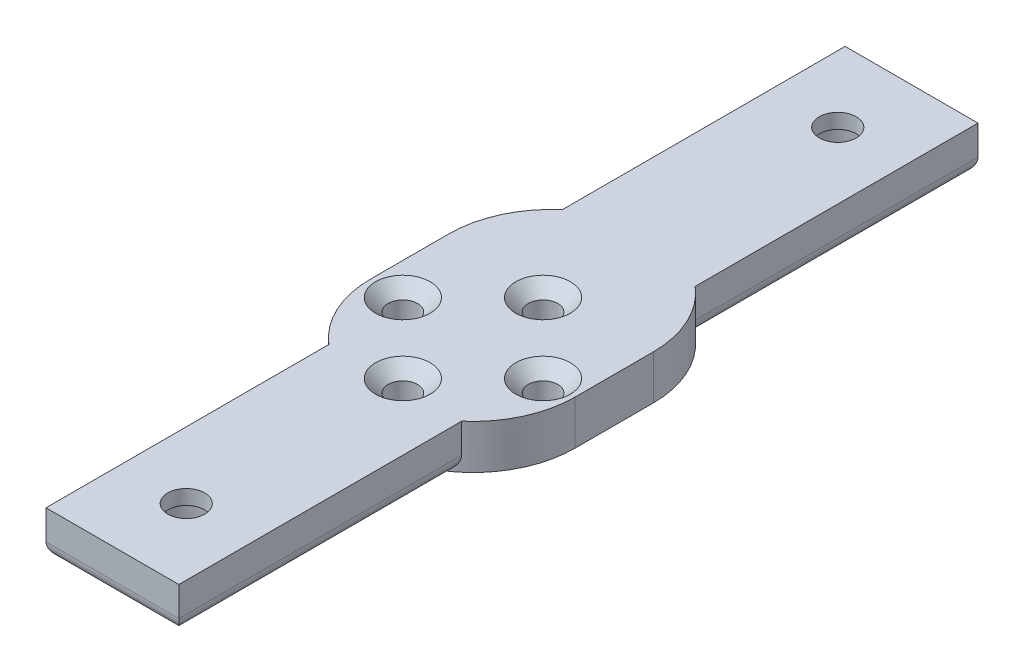
ISO-10303-21;
HEADER;
FILE_DESCRIPTION(('STEP AP214'),'2;1');
FILE_NAME('part.step','',(''),(''),'','','');
FILE_SCHEMA(('AUTOMOTIVE_DESIGN { 1 0 10303 214 1 1 1 1 }'));
ENDSEC;
DATA;
#1=APPLICATION_CONTEXT('core data for automotive mechanical design processes');
#2=APPLICATION_PROTOCOL_DEFINITION('international standard','automotive_design',2000,#1);
#3=PRODUCT_CONTEXT('',#1,'mechanical');
#4=PRODUCT('Part','Part','',(#3));
#5=PRODUCT_RELATED_PRODUCT_CATEGORY('part','',(#4));
#6=PRODUCT_DEFINITION_FORMATION('','',#4);
#7=PRODUCT_DEFINITION_CONTEXT('part definition',#1,'design');
#8=PRODUCT_DEFINITION('design','',#6,#7);
#9=PRODUCT_DEFINITION_SHAPE('','',#8);
#10=(LENGTH_UNIT() NAMED_UNIT(*) SI_UNIT(.MILLI.,.METRE.));
#11=(NAMED_UNIT(*) PLANE_ANGLE_UNIT() SI_UNIT($,.RADIAN.));
#12=(NAMED_UNIT(*) SI_UNIT($,.STERADIAN.) SOLID_ANGLE_UNIT());
#13=UNCERTAINTY_MEASURE_WITH_UNIT(LENGTH_MEASURE(1.E-05),#10,'distance_accuracy_value','');
#14=(GEOMETRIC_REPRESENTATION_CONTEXT(3) GLOBAL_UNCERTAINTY_ASSIGNED_CONTEXT((#13)) GLOBAL_UNIT_ASSIGNED_CONTEXT((#10,
#11,#12)) REPRESENTATION_CONTEXT('',''));
#15=CARTESIAN_POINT('',(0.,0.,0.));
#16=DIRECTION('',(0.,0.,1.));
#17=DIRECTION('',(1.,0.,0.));
#18=AXIS2_PLACEMENT_3D('',#15,#16,#17);
#19=CARTESIAN_POINT('',(0.,0.,44.14));
#20=DIRECTION('',(0.,1.,0.));
#21=DIRECTION('',(0.,0.,1.));
#22=AXIS2_PLACEMENT_3D('',#19,#20,#21);
#23=CYLINDRICAL_SURFACE('',#22,2.5);
#24=CARTESIAN_POINT('',(0.,6.,44.14));
#25=DIRECTION('',(0.,1.,0.));
#26=DIRECTION('',(0.,0.,1.));
#27=AXIS2_PLACEMENT_3D('',#24,#25,#26);
#28=CIRCLE('',#27,2.5);
#29=CARTESIAN_POINT('',(0.,6.,46.64));
#30=VERTEX_POINT('',#29);
#31=EDGE_CURVE('E451',#30,#30,#28,.T.);
#32=ORIENTED_EDGE('',*,*,#31,.T.);
#33=EDGE_LOOP('',(#32));
#34=FACE_BOUND('',#33,.T.);
#35=CARTESIAN_POINT('',(0.,4.,44.14));
#36=DIRECTION('',(0.,-1.,0.));
#37=DIRECTION('',(0.,0.,-1.));
#38=AXIS2_PLACEMENT_3D('',#35,#36,#37);
#39=CIRCLE('',#38,2.5);
#40=CARTESIAN_POINT('',(0.,4.,41.64));
#41=VERTEX_POINT('',#40);
#42=EDGE_CURVE('E45',#41,#41,#39,.F.);
#43=ORIENTED_EDGE('',*,*,#42,.F.);
#44=EDGE_LOOP('',(#43));
#45=FACE_BOUND('',#44,.T.);
#46=ADVANCED_FACE('F40',(#34,#45),#23,.F.);
#47=CARTESIAN_POINT('',(0.,0.,-44.14));
#48=DIRECTION('',(0.,1.,0.));
#49=DIRECTION('',(0.,0.,1.));
#50=AXIS2_PLACEMENT_3D('',#47,#48,#49);
#51=CYLINDRICAL_SURFACE('',#50,2.5);
#52=CARTESIAN_POINT('',(0.,6.,-44.14));
#53=DIRECTION('',(0.,1.,0.));
#54=DIRECTION('',(0.,0.,1.));
#55=AXIS2_PLACEMENT_3D('',#52,#53,#54);
#56=CIRCLE('',#55,2.5);
#57=CARTESIAN_POINT('',(0.,6.,-41.64));
#58=VERTEX_POINT('',#57);
#59=EDGE_CURVE('E429',#58,#58,#56,.T.);
#60=ORIENTED_EDGE('',*,*,#59,.T.);
#61=EDGE_LOOP('',(#60));
#62=FACE_BOUND('',#61,.T.);
#63=CARTESIAN_POINT('',(0.,4.,-44.14));
#64=DIRECTION('',(0.,-1.,0.));
#65=DIRECTION('',(0.,0.,-1.));
#66=AXIS2_PLACEMENT_3D('',#63,#64,#65);
#67=CIRCLE('',#66,2.5);
#68=CARTESIAN_POINT('',(0.,4.,-46.64));
#69=VERTEX_POINT('',#68);
#70=EDGE_CURVE('E475',#69,#69,#67,.F.);
#71=ORIENTED_EDGE('',*,*,#70,.F.);
#72=EDGE_LOOP('',(#71));
#73=FACE_BOUND('',#72,.T.);
#74=ADVANCED_FACE('F322',(#62,#73),#51,.F.);
#75=CARTESIAN_POINT('',(0.,6.,5.29));
#76=DIRECTION('',(0.,-1.,0.));
#77=DIRECTION('',(0.,0.,-1.));
#78=AXIS2_PLACEMENT_3D('',#75,#76,#77);
#79=CYLINDRICAL_SURFACE('',#78,13.85);
#80=CARTESIAN_POINT('',(0.,0.,5.29));
#81=DIRECTION('',(0.,1.,0.));
#82=DIRECTION('',(0.,0.,1.));
#83=AXIS2_PLACEMENT_3D('',#80,#81,#82);
#84=CIRCLE('',#83,13.85);
#85=CARTESIAN_POINT('',(7.,0.,17.2408367907858));
#86=VERTEX_POINT('',#85);
#87=CARTESIAN_POINT('',(13.85,0.,5.29));
#88=VERTEX_POINT('',#87);
#89=EDGE_CURVE('E180',#86,#88,#84,.T.);
#90=ORIENTED_EDGE('',*,*,#89,.T.);
#91=DIRECTION('',(0.,-1.,0.));
#92=VECTOR('',#91,1.);
#93=CARTESIAN_POINT('',(13.85,6.,5.29));
#94=LINE('',#93,#92);
#95=CARTESIAN_POINT('',(13.85,6.,5.29));
#96=VERTEX_POINT('',#95);
#97=EDGE_CURVE('E163',#96,#88,#94,.T.);
#98=ORIENTED_EDGE('',*,*,#97,.F.);
#99=CARTESIAN_POINT('',(0.,6.,5.29));
#100=DIRECTION('',(0.,1.,0.));
#101=DIRECTION('',(0.,0.,1.));
#102=AXIS2_PLACEMENT_3D('',#99,#100,#101);
#103=CIRCLE('',#102,13.85);
#104=CARTESIAN_POINT('',(9.,6.,15.8172266053315));
#105=VERTEX_POINT('',#104);
#106=EDGE_CURVE('E170',#105,#96,#103,.T.);
#107=ORIENTED_EDGE('',*,*,#106,.F.);
#108=DIRECTION('',(0.,-1.,0.));
#109=VECTOR('',#108,1.);
#110=CARTESIAN_POINT('',(9.,6.,15.8172266053315));
#111=LINE('',#110,#109);
#112=CARTESIAN_POINT('',(9.,2.,15.8172266053315));
#113=VERTEX_POINT('',#112);
#114=EDGE_CURVE('E368',#105,#113,#111,.T.);
#115=ORIENTED_EDGE('',*,*,#114,.T.);
#116=CARTESIAN_POINT('',(9.,2.,15.8172266053315));
#117=CARTESIAN_POINT('',(9.00001095199779,1.95251782542655,15.817214376835));
#118=CARTESIAN_POINT('',(8.99830946511427,1.90504449968837,15.8186718289643));
#119=CARTESIAN_POINT('',(8.99156649079789,1.81054404627902,15.8244324793492));
#120=CARTESIAN_POINT('',(8.98652750468909,1.76351661118295,15.8287335464233));
#121=CARTESIAN_POINT('',(8.97324761402517,1.67063790530944,15.8400425623307));
#122=CARTESIAN_POINT('',(8.96503269828393,1.6247802284052,15.8470285377406));
#123=CARTESIAN_POINT('',(8.94555196645326,1.53419207833459,15.8635407156647));
#124=CARTESIAN_POINT('',(8.93428572401967,1.48946176364336,15.8730672731568));
#125=CARTESIAN_POINT('',(8.89623779243,1.35765387646323,15.9051097070624));
#126=CARTESIAN_POINT('',(8.86515602397354,1.27261611503582,15.9311323199702));
#127=CARTESIAN_POINT('',(8.79309485469454,1.10960742208109,15.9907555039185));
#128=CARTESIAN_POINT('',(8.75209258393457,1.03165340047762,16.0243735728905));
#129=CARTESIAN_POINT('',(8.64545280055409,0.857030755174784,16.1105756121981));
#130=CARTESIAN_POINT('',(8.57626242931097,0.763742487914281,16.1656283331257));
#131=CARTESIAN_POINT('',(8.42569014963155,0.592721846609739,16.28269598785));
#132=CARTESIAN_POINT('',(8.34429306919866,0.515009116646321,16.3447195614952));
#133=CARTESIAN_POINT('',(8.17051369513479,0.374404239188389,16.473786679172));
#134=CARTESIAN_POINT('',(8.07798778300365,0.311746199894971,16.5408905117409));
#135=CARTESIAN_POINT('',(7.8850390996485,0.203067226488435,16.6769488888683));
#136=CARTESIAN_POINT('',(7.78462054314283,0.157037485278831,16.7459024328844));
#137=CARTESIAN_POINT('',(7.57286417581339,0.0803492295482757,16.8870299507223));
#138=CARTESIAN_POINT('',(7.46123755522321,0.0504840341391643,16.9592079158384));
#139=CARTESIAN_POINT('',(7.29043849222303,0.0203546031253727,17.0661007894726));
#140=CARTESIAN_POINT('',(7.23291536599567,0.0127560590789741,17.1015204800613));
#141=CARTESIAN_POINT('',(7.11702309592852,0.00258045803190374,17.1717120166233));
#142=CARTESIAN_POINT('',(7.05865380336938,4.29479709307488E-06,17.2064837461974));
#143=CARTESIAN_POINT('',(7.,0.,17.2408367907858));
#144=B_SPLINE_CURVE_WITH_KNOTS('',3,(#116,#117,#118,#119,#120,#121,#122,#123,#124,#125,#126,
#127,#128,#129,#130,#131,#132,#133,#134,#135,#136,#137,#138,#139,#140,#141,#142,#143),
.UNSPECIFIED.,.F.,.F.,(4,2,2,2,2,2,2,2,2,2,2,2,2,4),(0.,0.142379274026289,0.284651960963157,
0.425784257251578,0.566936283317743,0.848204754906137,1.13012792431313,1.51365465875208,
1.89766209994334,2.28730216197175,2.67673554943238,3.08386097924502,3.2876320241218,
3.491439328094),.UNSPECIFIED.);
#145=EDGE_CURVE('E11',#113,#86,#144,.T.);
#146=ORIENTED_EDGE('',*,*,#145,.T.);
#147=EDGE_LOOP('',(#90,#98,#107,#115,#146));
#148=FACE_BOUND('',#147,.T.);
#149=ADVANCED_FACE('F179',(#148),#79,.T.);
#150=CARTESIAN_POINT('',(13.85,6.,-5.28999999999999));
#151=DIRECTION('',(-1.,0.,0.));
#152=DIRECTION('',(0.,0.,1.));
#153=AXIS2_PLACEMENT_3D('',#150,#151,#152);
#154=PLANE('',#153);
#155=DIRECTION('',(0.,0.,-1.));
#156=VECTOR('',#155,1.);
#157=CARTESIAN_POINT('',(13.85,0.,-5.28999999999999));
#158=LINE('',#157,#156);
#159=CARTESIAN_POINT('',(13.85,0.,-5.28999999999999));
#160=VERTEX_POINT('',#159);
#161=EDGE_CURVE('E428',#88,#160,#158,.T.);
#162=ORIENTED_EDGE('',*,*,#161,.T.);
#163=DIRECTION('',(0.,-1.,0.));
#164=VECTOR('',#163,1.);
#165=CARTESIAN_POINT('',(13.85,6.,-5.28999999999999));
#166=LINE('',#165,#164);
#167=CARTESIAN_POINT('',(13.85,6.,-5.28999999999999));
#168=VERTEX_POINT('',#167);
#169=EDGE_CURVE('E166',#168,#160,#166,.T.);
#170=ORIENTED_EDGE('',*,*,#169,.F.);
#171=DIRECTION('',(0.,0.,-1.));
#172=VECTOR('',#171,1.);
#173=CARTESIAN_POINT('',(13.85,6.,-5.28999999999999));
#174=LINE('',#173,#172);
#175=EDGE_CURVE('E159',#96,#168,#174,.T.);
#176=ORIENTED_EDGE('',*,*,#175,.F.);
#177=ORIENTED_EDGE('',*,*,#97,.T.);
#178=EDGE_LOOP('',(#162,#170,#176,#177));
#179=FACE_BOUND('',#178,.T.);
#180=ADVANCED_FACE('F161',(#179),#154,.F.);
#181=CARTESIAN_POINT('',(0.,6.,-5.29));
#182=DIRECTION('',(0.,-1.,0.));
#183=DIRECTION('',(0.,0.,-1.));
#184=AXIS2_PLACEMENT_3D('',#181,#182,#183);
#185=CYLINDRICAL_SURFACE('',#184,13.85);
#186=CARTESIAN_POINT('',(0.,0.,-5.29));
#187=DIRECTION('',(0.,1.,0.));
#188=DIRECTION('',(0.,0.,1.));
#189=AXIS2_PLACEMENT_3D('',#186,#187,#188);
#190=CIRCLE('',#189,13.85);
#191=CARTESIAN_POINT('',(7.,0.,-17.2408367907858));
#192=VERTEX_POINT('',#191);
#193=EDGE_CURVE('E431',#160,#192,#190,.T.);
#194=ORIENTED_EDGE('',*,*,#193,.T.);
#195=CARTESIAN_POINT('',(7.,0.,-17.2408367907858));
#196=CARTESIAN_POINT('',(7.07352465327435,3.77273996041876E-06,-17.1977813480599));
#197=CARTESIAN_POINT('',(7.14662260767783,0.00405392002933719,-17.1540441585525));
#198=CARTESIAN_POINT('',(7.29137080125101,0.0199981707242653,-17.0656332153794));
#199=CARTESIAN_POINT('',(7.36302125666061,0.031891093443273,-17.020959603667));
#200=CARTESIAN_POINT('',(7.50454406687667,0.0633258824829022,-16.9309359447912));
#201=CARTESIAN_POINT('',(7.5744095071047,0.0828937538111077,-16.8855841074879));
#202=CARTESIAN_POINT('',(7.71155493848579,0.129455860354729,-16.7948334421397));
#203=CARTESIAN_POINT('',(7.77883505264482,0.15644974175178,-16.7494346164363));
#204=CARTESIAN_POINT('',(7.96339622952131,0.242431505556305,-16.6225862892808));
#205=CARTESIAN_POINT('',(8.07726451382617,0.309669181167672,-16.5415764399004));
#206=CARTESIAN_POINT('',(8.29153589888085,0.467167049430803,-16.3846172656811));
#207=CARTESIAN_POINT('',(8.39196492312664,0.557381914786786,-16.3086583446528));
#208=CARTESIAN_POINT('',(8.55128864744012,0.733641477184531,-16.1851970712495));
#209=CARTESIAN_POINT('',(8.6141587469291,0.814536910256096,-16.1354662244835));
#210=CARTESIAN_POINT('',(8.7282695061853,0.988152583738709,-16.04384354077));
#211=CARTESIAN_POINT('',(8.77952500070322,1.08085750122181,-16.001941716353));
#212=CARTESIAN_POINT('',(8.85999991062907,1.25956080008467,-15.9354283171054));
#213=CARTESIAN_POINT('',(8.89150886038983,1.34387517544492,-15.9090723258799));
#214=CARTESIAN_POINT('',(8.9431920412304,1.51811377077475,-15.8655836913324));
#215=CARTESIAN_POINT('',(8.96338962475816,1.60802600400725,-15.8484320486076));
#216=CARTESIAN_POINT('',(8.98481254374359,1.74894195879301,-15.8301962507505));
#217=CARTESIAN_POINT('',(8.99049115757889,1.79883434549062,-15.8253504476925));
#218=CARTESIAN_POINT('',(8.99809012332074,1.8991402030744,-15.8188595655471));
#219=CARTESIAN_POINT('',(9.00000819525659,1.94955397146162,-15.8172164282003));
#220=CARTESIAN_POINT('',(9.,2.,-15.8172266053315));
#221=B_SPLINE_CURVE_WITH_KNOTS('',3,(#195,#196,#197,#198,#199,#200,#201,#202,#203,#204,#205,
#206,#207,#208,#209,#210,#211,#212,#213,#214,#215,#216,#217,#218,#219,#220),.UNSPECIFIED.,.F.,
.F.,(4,2,2,2,2,2,2,2,2,2,2,2,4),(0.,0.255475942845585,0.510913433975762,0.767224005728025,
1.02352236746644,1.48642333208736,1.94841810690335,2.28884480508288,2.62883421129738,
2.90908093202752,3.18874692691036,3.3398699169079,3.49108450263308),.UNSPECIFIED.);
#222=CARTESIAN_POINT('',(9.,2.,-15.8172266053315));
#223=VERTEX_POINT('',#222);
#224=EDGE_CURVE('E236',#192,#223,#221,.T.);
#225=ORIENTED_EDGE('',*,*,#224,.T.);
#226=DIRECTION('',(0.,-1.,0.));
#227=VECTOR('',#226,1.);
#228=CARTESIAN_POINT('',(9.,6.,-15.8172266053315));
#229=LINE('',#228,#227);
#230=CARTESIAN_POINT('',(9.,6.,-15.8172266053315));
#231=VERTEX_POINT('',#230);
#232=EDGE_CURVE('E186',#231,#223,#229,.T.);
#233=ORIENTED_EDGE('',*,*,#232,.F.);
#234=CARTESIAN_POINT('',(0.,6.,-5.29));
#235=DIRECTION('',(0.,1.,0.));
#236=DIRECTION('',(0.,0.,1.));
#237=AXIS2_PLACEMENT_3D('',#234,#235,#236);
#238=CIRCLE('',#237,13.85);
#239=EDGE_CURVE('E169',#168,#231,#238,.T.);
#240=ORIENTED_EDGE('',*,*,#239,.F.);
#241=ORIENTED_EDGE('',*,*,#169,.T.);
#242=EDGE_LOOP('',(#194,#225,#233,#240,#241));
#243=FACE_BOUND('',#242,.T.);
#244=ADVANCED_FACE('F252',(#243),#185,.T.);
#245=CARTESIAN_POINT('',(9.,6.,-15.8172266053315));
#246=DIRECTION('',(-1.,0.,0.));
#247=DIRECTION('',(0.,0.,1.));
#248=AXIS2_PLACEMENT_3D('',#245,#246,#247);
#249=PLANE('',#248);
#250=ORIENTED_EDGE('',*,*,#232,.T.);
#251=DIRECTION('',(0.,0.,-1.));
#252=VECTOR('',#251,1.);
#253=CARTESIAN_POINT('',(9.,2.,-15.8172266053315));
#254=LINE('',#253,#252);
#255=CARTESIAN_POINT('',(9.,2.,-54.14));
#256=VERTEX_POINT('',#255);
#257=EDGE_CURVE('E210',#223,#256,#254,.T.);
#258=ORIENTED_EDGE('',*,*,#257,.T.);
#259=DIRECTION('',(0.,-1.,0.));
#260=VECTOR('',#259,1.);
#261=CARTESIAN_POINT('',(9.,6.,-54.14));
#262=LINE('',#261,#260);
#263=CARTESIAN_POINT('',(9.,6.,-54.14));
#264=VERTEX_POINT('',#263);
#265=EDGE_CURVE('E383',#264,#256,#262,.T.);
#266=ORIENTED_EDGE('',*,*,#265,.F.);
#267=DIRECTION('',(0.,0.,-1.));
#268=VECTOR('',#267,1.);
#269=CARTESIAN_POINT('',(9.,6.,-15.8172266053315));
#270=LINE('',#269,#268);
#271=EDGE_CURVE('E389',#231,#264,#270,.T.);
#272=ORIENTED_EDGE('',*,*,#271,.F.);
#273=EDGE_LOOP('',(#250,#258,#266,#272));
#274=FACE_BOUND('',#273,.T.);
#275=ADVANCED_FACE('F312',(#274),#249,.F.);
#276=CARTESIAN_POINT('',(-9.,6.,-54.14));
#277=DIRECTION('',(0.,0.,1.));
#278=DIRECTION('',(1.,0.,0.));
#279=AXIS2_PLACEMENT_3D('',#276,#277,#278);
#280=PLANE('',#279);
#281=ORIENTED_EDGE('',*,*,#265,.T.);
#282=DIRECTION('',(-1.,0.,0.));
#283=VECTOR('',#282,1.);
#284=CARTESIAN_POINT('',(-9.,2.,-54.14));
#285=LINE('',#284,#283);
#286=CARTESIAN_POINT('',(-9.,2.,-54.14));
#287=VERTEX_POINT('',#286);
#288=EDGE_CURVE('E227',#256,#287,#285,.T.);
#289=ORIENTED_EDGE('',*,*,#288,.T.);
#290=DIRECTION('',(0.,-1.,0.));
#291=VECTOR('',#290,1.);
#292=CARTESIAN_POINT('',(-9.,6.,-54.14));
#293=LINE('',#292,#291);
#294=CARTESIAN_POINT('',(-9.,6.,-54.14));
#295=VERTEX_POINT('',#294);
#296=EDGE_CURVE('E380',#295,#287,#293,.T.);
#297=ORIENTED_EDGE('',*,*,#296,.F.);
#298=DIRECTION('',(-1.,0.,0.));
#299=VECTOR('',#298,1.);
#300=CARTESIAN_POINT('',(-9.,6.,-54.14));
#301=LINE('',#300,#299);
#302=EDGE_CURVE('E418',#264,#295,#301,.T.);
#303=ORIENTED_EDGE('',*,*,#302,.F.);
#304=EDGE_LOOP('',(#281,#289,#297,#303));
#305=FACE_BOUND('',#304,.T.);
#306=ADVANCED_FACE('F309',(#305),#280,.F.);
#307=CARTESIAN_POINT('',(-8.99999999999999,6.,-15.8172266053315));
#308=DIRECTION('',(1.,0.,0.));
#309=DIRECTION('',(0.,0.,-1.));
#310=AXIS2_PLACEMENT_3D('',#307,#308,#309);
#311=PLANE('',#310);
#312=ORIENTED_EDGE('',*,*,#296,.T.);
#313=DIRECTION('',(0.,0.,1.));
#314=VECTOR('',#313,1.);
#315=CARTESIAN_POINT('',(-8.99999999999999,2.,-15.8172266053315));
#316=LINE('',#315,#314);
#317=CARTESIAN_POINT('',(-8.99999999999999,2.,-15.8172266053315));
#318=VERTEX_POINT('',#317);
#319=EDGE_CURVE('E229',#287,#318,#316,.T.);
#320=ORIENTED_EDGE('',*,*,#319,.T.);
#321=DIRECTION('',(0.,-1.,0.));
#322=VECTOR('',#321,1.);
#323=CARTESIAN_POINT('',(-8.99999999999999,6.,-15.8172266053315));
#324=LINE('',#323,#322);
#325=CARTESIAN_POINT('',(-8.99999999999999,6.,-15.8172266053315));
#326=VERTEX_POINT('',#325);
#327=EDGE_CURVE('E377',#326,#318,#324,.T.);
#328=ORIENTED_EDGE('',*,*,#327,.F.);
#329=DIRECTION('',(0.,0.,1.));
#330=VECTOR('',#329,1.);
#331=CARTESIAN_POINT('',(-8.99999999999999,6.,-15.8172266053315));
#332=LINE('',#331,#330);
#333=EDGE_CURVE('E405',#295,#326,#332,.T.);
#334=ORIENTED_EDGE('',*,*,#333,.F.);
#335=EDGE_LOOP('',(#312,#320,#328,#334));
#336=FACE_BOUND('',#335,.T.);
#337=ADVANCED_FACE('F305',(#336),#311,.F.);
#338=CARTESIAN_POINT('',(0.,6.,-5.29));
#339=DIRECTION('',(0.,-1.,0.));
#340=DIRECTION('',(0.,0.,-1.));
#341=AXIS2_PLACEMENT_3D('',#338,#339,#340);
#342=CYLINDRICAL_SURFACE('',#341,13.85);
#343=CARTESIAN_POINT('',(0.,0.,-5.29));
#344=DIRECTION('',(0.,1.,0.));
#345=DIRECTION('',(0.,0.,1.));
#346=AXIS2_PLACEMENT_3D('',#343,#344,#345);
#347=CIRCLE('',#346,13.85);
#348=CARTESIAN_POINT('',(-6.99999999999999,0.,-17.2408367907858));
#349=VERTEX_POINT('',#348);
#350=CARTESIAN_POINT('',(-13.85,0.,-5.29));
#351=VERTEX_POINT('',#350);
#352=EDGE_CURVE('E410',#349,#351,#347,.T.);
#353=ORIENTED_EDGE('',*,*,#352,.T.);
#354=DIRECTION('',(0.,-1.,0.));
#355=VECTOR('',#354,1.);
#356=CARTESIAN_POINT('',(-13.85,6.,-5.29));
#357=LINE('',#356,#355);
#358=CARTESIAN_POINT('',(-13.85,6.,-5.29));
#359=VERTEX_POINT('',#358);
#360=EDGE_CURVE('E374',#359,#351,#357,.T.);
#361=ORIENTED_EDGE('',*,*,#360,.F.);
#362=CARTESIAN_POINT('',(0.,6.,-5.29));
#363=DIRECTION('',(0.,1.,0.));
#364=DIRECTION('',(0.,0.,1.));
#365=AXIS2_PLACEMENT_3D('',#362,#363,#364);
#366=CIRCLE('',#365,13.85);
#367=EDGE_CURVE('E412',#326,#359,#366,.T.);
#368=ORIENTED_EDGE('',*,*,#367,.F.);
#369=ORIENTED_EDGE('',*,*,#327,.T.);
#370=CARTESIAN_POINT('',(-8.99999999999999,2.,-15.8172266053315));
#371=CARTESIAN_POINT('',(-9.00001095199779,1.95251782542655,-15.817214376835));
#372=CARTESIAN_POINT('',(-8.99830946511426,1.90504449968837,-15.8186718289643));
#373=CARTESIAN_POINT('',(-8.99156649079789,1.81054404627902,-15.8244324793492));
#374=CARTESIAN_POINT('',(-8.98652750468909,1.76351661118295,-15.8287335464233));
#375=CARTESIAN_POINT('',(-8.97324761402517,1.67063790530944,-15.8400425623307));
#376=CARTESIAN_POINT('',(-8.96503269828393,1.6247802284052,-15.8470285377406));
#377=CARTESIAN_POINT('',(-8.94555196645325,1.53419207833459,-15.8635407156647));
#378=CARTESIAN_POINT('',(-8.93428572401967,1.48946176364336,-15.8730672731568));
#379=CARTESIAN_POINT('',(-8.89623779243,1.35765387646323,-15.9051097070624));
#380=CARTESIAN_POINT('',(-8.86515602397353,1.27261611503582,-15.9311323199702));
#381=CARTESIAN_POINT('',(-8.79309485469454,1.10960742208109,-15.9907555039185));
#382=CARTESIAN_POINT('',(-8.75209258393457,1.03165340047762,-16.0243735728905));
#383=CARTESIAN_POINT('',(-8.64545280055409,0.857030755174783,-16.1105756121981));
#384=CARTESIAN_POINT('',(-8.57626242931097,0.763742487914279,-16.1656283331257));
#385=CARTESIAN_POINT('',(-8.42569014963155,0.592721846609737,-16.28269598785));
#386=CARTESIAN_POINT('',(-8.34429306919866,0.515009116646319,-16.3447195614952));
#387=CARTESIAN_POINT('',(-8.17051369513478,0.374404239188386,-16.473786679172));
#388=CARTESIAN_POINT('',(-8.07798778300364,0.311746199894969,-16.5408905117409));
#389=CARTESIAN_POINT('',(-7.88503909964849,0.203067226488433,-16.6769488888683));
#390=CARTESIAN_POINT('',(-7.78462054314282,0.15703748527883,-16.7459024328844));
#391=CARTESIAN_POINT('',(-7.57286417581338,0.0803492295482752,-16.8870299507223));
#392=CARTESIAN_POINT('',(-7.4612375552232,0.0504840341391636,-16.9592079158384));
#393=CARTESIAN_POINT('',(-7.29043849222302,0.020354603125372,-17.0661007894726));
#394=CARTESIAN_POINT('',(-7.23291536599566,0.0127560590789736,-17.1015204800613));
#395=CARTESIAN_POINT('',(-7.11702309592851,0.00258045803190327,-17.1717120166233));
#396=CARTESIAN_POINT('',(-7.05865380336938,4.29479709272052E-06,-17.2064837461974));
#397=CARTESIAN_POINT('',(-6.99999999999999,0.,-17.2408367907858));
#398=B_SPLINE_CURVE_WITH_KNOTS('',3,(#370,#371,#372,#373,#374,#375,#376,#377,#378,#379,#380,
#381,#382,#383,#384,#385,#386,#387,#388,#389,#390,#391,#392,#393,#394,#395,#396,#397),
.UNSPECIFIED.,.F.,.F.,(4,2,2,2,2,2,2,2,2,2,2,2,2,4),(0.,0.142379274026289,0.284651960963157,
0.425784257251578,0.566936283317743,0.848204754906136,1.13012792431313,1.51365465875208,
1.89766209994335,2.28730216197175,2.67673554943239,3.08386097924503,3.2876320241218,
3.49143932809401),.UNSPECIFIED.);
#399=EDGE_CURVE('E244',#318,#349,#398,.T.);
#400=ORIENTED_EDGE('',*,*,#399,.T.);
#401=EDGE_LOOP('',(#353,#361,#368,#369,#400));
#402=FACE_BOUND('',#401,.T.);
#403=ADVANCED_FACE('F300',(#402),#342,.T.);
#404=CARTESIAN_POINT('',(-13.85,6.,-5.29));
#405=DIRECTION('',(1.,0.,0.));
#406=DIRECTION('',(0.,0.,-1.));
#407=AXIS2_PLACEMENT_3D('',#404,#405,#406);
#408=PLANE('',#407);
#409=DIRECTION('',(0.,0.,1.));
#410=VECTOR('',#409,1.);
#411=CARTESIAN_POINT('',(-13.85,0.,-5.29));
#412=LINE('',#411,#410);
#413=CARTESIAN_POINT('',(-13.85,0.,5.29000000000001));
#414=VERTEX_POINT('',#413);
#415=EDGE_CURVE('E434',#351,#414,#412,.T.);
#416=ORIENTED_EDGE('',*,*,#415,.T.);
#417=DIRECTION('',(0.,-1.,0.));
#418=VECTOR('',#417,1.);
#419=CARTESIAN_POINT('',(-13.85,6.,5.29000000000001));
#420=LINE('',#419,#418);
#421=CARTESIAN_POINT('',(-13.85,6.,5.29000000000001));
#422=VERTEX_POINT('',#421);
#423=EDGE_CURVE('E366',#422,#414,#420,.T.);
#424=ORIENTED_EDGE('',*,*,#423,.F.);
#425=DIRECTION('',(0.,0.,1.));
#426=VECTOR('',#425,1.);
#427=CARTESIAN_POINT('',(-13.85,6.,-5.29));
#428=LINE('',#427,#426);
#429=EDGE_CURVE('E414',#359,#422,#428,.T.);
#430=ORIENTED_EDGE('',*,*,#429,.F.);
#431=ORIENTED_EDGE('',*,*,#360,.T.);
#432=EDGE_LOOP('',(#416,#424,#430,#431));
#433=FACE_BOUND('',#432,.T.);
#434=ADVANCED_FACE('F296',(#433),#408,.F.);
#435=CARTESIAN_POINT('',(0.,6.,5.29));
#436=DIRECTION('',(0.,-1.,0.));
#437=DIRECTION('',(0.,0.,-1.));
#438=AXIS2_PLACEMENT_3D('',#435,#436,#437);
#439=CYLINDRICAL_SURFACE('',#438,13.85);
#440=CARTESIAN_POINT('',(0.,0.,5.29));
#441=DIRECTION('',(0.,1.,0.));
#442=DIRECTION('',(0.,0.,1.));
#443=AXIS2_PLACEMENT_3D('',#440,#441,#442);
#444=CIRCLE('',#443,13.85);
#445=CARTESIAN_POINT('',(-6.99999999999999,0.,17.2408367907858));
#446=VERTEX_POINT('',#445);
#447=EDGE_CURVE('E177',#414,#446,#444,.T.);
#448=ORIENTED_EDGE('',*,*,#447,.T.);
#449=CARTESIAN_POINT('',(-6.99999999999999,0.,17.2408367907858));
#450=CARTESIAN_POINT('',(-7.07352465327435,3.77273996011865E-06,17.1977813480599));
#451=CARTESIAN_POINT('',(-7.14662260767783,0.00405392002933714,17.1540441585525));
#452=CARTESIAN_POINT('',(-7.29137080125101,0.019998170724266,17.0656332153794));
#453=CARTESIAN_POINT('',(-7.36302125666061,0.031891093443274,17.020959603667));
#454=CARTESIAN_POINT('',(-7.50454406687667,0.0633258824829032,16.9309359447912));
#455=CARTESIAN_POINT('',(-7.5744095071047,0.0828937538111086,16.8855841074879));
#456=CARTESIAN_POINT('',(-7.71155493848578,0.12945586035473,16.7948334421397));
#457=CARTESIAN_POINT('',(-7.77883505264482,0.15644974175178,16.7494346164363));
#458=CARTESIAN_POINT('',(-7.96339622952131,0.242431505556305,16.6225862892808));
#459=CARTESIAN_POINT('',(-8.07726451382617,0.309669181167672,16.5415764399004));
#460=CARTESIAN_POINT('',(-8.29153589888085,0.467167049430803,16.3846172656811));
#461=CARTESIAN_POINT('',(-8.39196492312664,0.557381914786788,16.3086583446528));
#462=CARTESIAN_POINT('',(-8.55128864744012,0.733641477184532,16.1851970712495));
#463=CARTESIAN_POINT('',(-8.61415874692909,0.814536910256096,16.1354662244835));
#464=CARTESIAN_POINT('',(-8.72826950618529,0.988152583738708,16.04384354077));
#465=CARTESIAN_POINT('',(-8.77952500070321,1.08085750122181,16.001941716353));
#466=CARTESIAN_POINT('',(-8.85999991062907,1.25956080008467,15.9354283171054));
#467=CARTESIAN_POINT('',(-8.89150886038983,1.34387517544492,15.9090723258799));
#468=CARTESIAN_POINT('',(-8.9431920412304,1.51811377077475,15.8655836913324));
#469=CARTESIAN_POINT('',(-8.96338962475816,1.60802600400725,15.8484320486076));
#470=CARTESIAN_POINT('',(-8.98481254374359,1.74894195879301,15.8301962507505));
#471=CARTESIAN_POINT('',(-8.99049115757888,1.79883434549062,15.8253504476925));
#472=CARTESIAN_POINT('',(-8.99809012332074,1.8991402030744,15.818859565547));
#473=CARTESIAN_POINT('',(-9.00000819525659,1.94955397146162,15.8172164282003));
#474=CARTESIAN_POINT('',(-8.99999999999999,2.,15.8172266053315));
#475=B_SPLINE_CURVE_WITH_KNOTS('',3,(#449,#450,#451,#452,#453,#454,#455,#456,#457,#458,#459,
#460,#461,#462,#463,#464,#465,#466,#467,#468,#469,#470,#471,#472,#473,#474),.UNSPECIFIED.,.F.,
.F.,(4,2,2,2,2,2,2,2,2,2,2,2,4),(0.,0.25547594284559,0.510913433975765,0.767224005728027,
1.02352236746644,1.48642333208735,1.94841810690334,2.28884480508288,2.62883421129738,
2.90908093202752,3.18874692691036,3.3398699169079,3.49108450263308),.UNSPECIFIED.);
#476=CARTESIAN_POINT('',(-9.,2.,15.8172266053315));
#477=VERTEX_POINT('',#476);
#478=EDGE_CURVE('E50',#446,#477,#475,.T.);
#479=ORIENTED_EDGE('',*,*,#478,.T.);
#480=DIRECTION('',(0.,-1.,0.));
#481=VECTOR('',#480,1.);
#482=CARTESIAN_POINT('',(-9.,6.,15.8172266053315));
#483=LINE('',#482,#481);
#484=CARTESIAN_POINT('',(-9.,6.,15.8172266053315));
#485=VERTEX_POINT('',#484);
#486=EDGE_CURVE('E362',#485,#477,#483,.T.);
#487=ORIENTED_EDGE('',*,*,#486,.F.);
#488=CARTESIAN_POINT('',(0.,6.,5.29));
#489=DIRECTION('',(0.,1.,0.));
#490=DIRECTION('',(0.,0.,1.));
#491=AXIS2_PLACEMENT_3D('',#488,#489,#490);
#492=CIRCLE('',#491,13.85);
#493=EDGE_CURVE('E416',#422,#485,#492,.T.);
#494=ORIENTED_EDGE('',*,*,#493,.F.);
#495=ORIENTED_EDGE('',*,*,#423,.T.);
#496=EDGE_LOOP('',(#448,#479,#487,#494,#495));
#497=FACE_BOUND('',#496,.T.);
#498=ADVANCED_FACE('F290',(#497),#439,.T.);
#499=CARTESIAN_POINT('',(-9.,6.,54.14));
#500=DIRECTION('',(1.,0.,0.));
#501=DIRECTION('',(0.,0.,-1.));
#502=AXIS2_PLACEMENT_3D('',#499,#500,#501);
#503=PLANE('',#502);
#504=ORIENTED_EDGE('',*,*,#486,.T.);
#505=DIRECTION('',(0.,0.,1.));
#506=VECTOR('',#505,1.);
#507=CARTESIAN_POINT('',(-9.,2.,54.14));
#508=LINE('',#507,#506);
#509=CARTESIAN_POINT('',(-9.,2.,54.14));
#510=VERTEX_POINT('',#509);
#511=EDGE_CURVE('E231',#477,#510,#508,.T.);
#512=ORIENTED_EDGE('',*,*,#511,.T.);
#513=DIRECTION('',(0.,-1.,0.));
#514=VECTOR('',#513,1.);
#515=CARTESIAN_POINT('',(-9.,6.,54.14));
#516=LINE('',#515,#514);
#517=CARTESIAN_POINT('',(-9.,6.,54.14));
#518=VERTEX_POINT('',#517);
#519=EDGE_CURVE('E359',#518,#510,#516,.T.);
#520=ORIENTED_EDGE('',*,*,#519,.F.);
#521=DIRECTION('',(0.,0.,1.));
#522=VECTOR('',#521,1.);
#523=CARTESIAN_POINT('',(-9.,6.,54.14));
#524=LINE('',#523,#522);
#525=EDGE_CURVE('E423',#485,#518,#524,.T.);
#526=ORIENTED_EDGE('',*,*,#525,.F.);
#527=EDGE_LOOP('',(#504,#512,#520,#526));
#528=FACE_BOUND('',#527,.T.);
#529=ADVANCED_FACE('F295',(#528),#503,.F.);
#530=CARTESIAN_POINT('',(-9.,6.,54.14));
#531=DIRECTION('',(0.,0.,-1.));
#532=DIRECTION('',(-1.,0.,0.));
#533=AXIS2_PLACEMENT_3D('',#530,#531,#532);
#534=PLANE('',#533);
#535=ORIENTED_EDGE('',*,*,#519,.T.);
#536=DIRECTION('',(1.,0.,0.));
#537=VECTOR('',#536,1.);
#538=CARTESIAN_POINT('',(-9.,2.,54.14));
#539=LINE('',#538,#537);
#540=CARTESIAN_POINT('',(9.,2.,54.14));
#541=VERTEX_POINT('',#540);
#542=EDGE_CURVE('E66',#510,#541,#539,.T.);
#543=ORIENTED_EDGE('',*,*,#542,.T.);
#544=DIRECTION('',(0.,-1.,0.));
#545=VECTOR('',#544,1.);
#546=CARTESIAN_POINT('',(9.,6.,54.14));
#547=LINE('',#546,#545);
#548=CARTESIAN_POINT('',(9.,6.,54.14));
#549=VERTEX_POINT('',#548);
#550=EDGE_CURVE('E363',#549,#541,#547,.T.);
#551=ORIENTED_EDGE('',*,*,#550,.F.);
#552=DIRECTION('',(1.,0.,0.));
#553=VECTOR('',#552,1.);
#554=CARTESIAN_POINT('',(-9.,6.,54.14));
#555=LINE('',#554,#553);
#556=EDGE_CURVE('E360',#518,#549,#555,.T.);
#557=ORIENTED_EDGE('',*,*,#556,.F.);
#558=EDGE_LOOP('',(#535,#543,#551,#557));
#559=FACE_BOUND('',#558,.T.);
#560=ADVANCED_FACE('F351',(#559),#534,.F.);
#561=CARTESIAN_POINT('',(9.,6.,54.14));
#562=DIRECTION('',(-1.,0.,0.));
#563=DIRECTION('',(0.,0.,1.));
#564=AXIS2_PLACEMENT_3D('',#561,#562,#563);
#565=PLANE('',#564);
#566=ORIENTED_EDGE('',*,*,#550,.T.);
#567=DIRECTION('',(0.,0.,-1.));
#568=VECTOR('',#567,1.);
#569=CARTESIAN_POINT('',(9.,2.,54.14));
#570=LINE('',#569,#568);
#571=EDGE_CURVE('E58',#541,#113,#570,.T.);
#572=ORIENTED_EDGE('',*,*,#571,.T.);
#573=ORIENTED_EDGE('',*,*,#114,.F.);
#574=DIRECTION('',(0.,0.,-1.));
#575=VECTOR('',#574,1.);
#576=CARTESIAN_POINT('',(9.,6.,54.14));
#577=LINE('',#576,#575);
#578=EDGE_CURVE('E175',#549,#105,#577,.T.);
#579=ORIENTED_EDGE('',*,*,#578,.F.);
#580=EDGE_LOOP('',(#566,#572,#573,#579));
#581=FACE_BOUND('',#580,.T.);
#582=ADVANCED_FACE('F345',(#581),#565,.F.);
#583=CARTESIAN_POINT('',(0.,6.,5.29));
#584=DIRECTION('',(0.,1.,0.));
#585=DIRECTION('',(0.,0.,1.));
#586=AXIS2_PLACEMENT_3D('',#583,#584,#585);
#587=PLANE('',#586);
#588=CARTESIAN_POINT('',(9.5,6.,5.29000000000001));
#589=DIRECTION('',(0.,1.,0.));
#590=DIRECTION('',(0.,0.,1.));
#591=AXIS2_PLACEMENT_3D('',#588,#589,#590);
#592=CIRCLE('',#591,3.70000000000002);
#593=CARTESIAN_POINT('',(9.5,6.,8.99000000000004));
#594=VERTEX_POINT('',#593);
#595=EDGE_CURVE('E198',#594,#594,#592,.F.);
#596=ORIENTED_EDGE('',*,*,#595,.T.);
#597=EDGE_LOOP('',(#596));
#598=FACE_BOUND('',#597,.T.);
#599=CARTESIAN_POINT('',(0.,6.,14.79));
#600=DIRECTION('',(0.,1.,0.));
#601=DIRECTION('',(0.,0.,1.));
#602=AXIS2_PLACEMENT_3D('',#599,#600,#601);
#603=CIRCLE('',#602,3.70000000000001);
#604=CARTESIAN_POINT('',(0.,6.,18.49));
#605=VERTEX_POINT('',#604);
#606=EDGE_CURVE('E195',#605,#605,#603,.F.);
#607=ORIENTED_EDGE('',*,*,#606,.T.);
#608=EDGE_LOOP('',(#607));
#609=FACE_BOUND('',#608,.T.);
#610=CARTESIAN_POINT('',(-9.49999999999999,6.,5.29000000000001));
#611=DIRECTION('',(0.,1.,0.));
#612=DIRECTION('',(0.,0.,1.));
#613=AXIS2_PLACEMENT_3D('',#610,#611,#612);
#614=CIRCLE('',#613,3.70000000000002);
#615=CARTESIAN_POINT('',(-9.49999999999999,6.,8.99000000000004));
#616=VERTEX_POINT('',#615);
#617=EDGE_CURVE('E192',#616,#616,#614,.F.);
#618=ORIENTED_EDGE('',*,*,#617,.T.);
#619=EDGE_LOOP('',(#618));
#620=FACE_BOUND('',#619,.T.);
#621=CARTESIAN_POINT('',(0.,6.,-4.20999999999999));
#622=DIRECTION('',(0.,1.,0.));
#623=DIRECTION('',(0.,0.,1.));
#624=AXIS2_PLACEMENT_3D('',#621,#622,#623);
#625=CIRCLE('',#624,3.70000000000001);
#626=CARTESIAN_POINT('',(0.,6.,-0.509999999999977));
#627=VERTEX_POINT('',#626);
#628=EDGE_CURVE('E184',#627,#627,#625,.F.);
#629=ORIENTED_EDGE('',*,*,#628,.T.);
#630=EDGE_LOOP('',(#629));
#631=FACE_BOUND('',#630,.T.);
#632=ORIENTED_EDGE('',*,*,#59,.F.);
#633=EDGE_LOOP('',(#632));
#634=FACE_BOUND('',#633,.T.);
#635=ORIENTED_EDGE('',*,*,#31,.F.);
#636=EDGE_LOOP('',(#635));
#637=FACE_BOUND('',#636,.T.);
#638=ORIENTED_EDGE('',*,*,#106,.T.);
#639=ORIENTED_EDGE('',*,*,#175,.T.);
#640=ORIENTED_EDGE('',*,*,#239,.T.);
#641=ORIENTED_EDGE('',*,*,#271,.T.);
#642=ORIENTED_EDGE('',*,*,#302,.T.);
#643=ORIENTED_EDGE('',*,*,#333,.T.);
#644=ORIENTED_EDGE('',*,*,#367,.T.);
#645=ORIENTED_EDGE('',*,*,#429,.T.);
#646=ORIENTED_EDGE('',*,*,#493,.T.);
#647=ORIENTED_EDGE('',*,*,#525,.T.);
#648=ORIENTED_EDGE('',*,*,#556,.T.);
#649=ORIENTED_EDGE('',*,*,#578,.T.);
#650=EDGE_LOOP('',(#638,#639,#640,#641,#642,#643,#644,#645,#646,#647,#648,#649));
#651=FACE_BOUND('',#650,.T.);
#652=ADVANCED_FACE('F173',(#598,#609,#620,#631,#634,#637,#651),#587,.T.);
#653=CARTESIAN_POINT('',(0.,0.,5.29));
#654=DIRECTION('',(0.,1.,0.));
#655=DIRECTION('',(0.,0.,1.));
#656=AXIS2_PLACEMENT_3D('',#653,#654,#655);
#657=PLANE('',#656);
#658=CARTESIAN_POINT('',(0.,0.,-44.14));
#659=DIRECTION('',(0.,-1.,0.));
#660=DIRECTION('',(0.,0.,-1.));
#661=AXIS2_PLACEMENT_3D('',#658,#659,#660);
#662=CIRCLE('',#661,4.25);
#663=CARTESIAN_POINT('',(0.,0.,-48.39));
#664=VERTEX_POINT('',#663);
#665=EDGE_CURVE('E470',#664,#664,#662,.T.);
#666=ORIENTED_EDGE('',*,*,#665,.F.);
#667=EDGE_LOOP('',(#666));
#668=FACE_BOUND('',#667,.T.);
#669=CARTESIAN_POINT('',(0.,0.,44.14));
#670=DIRECTION('',(0.,-1.,0.));
#671=DIRECTION('',(0.,0.,-1.));
#672=AXIS2_PLACEMENT_3D('',#669,#670,#671);
#673=CIRCLE('',#672,4.25);
#674=CARTESIAN_POINT('',(0.,0.,39.89));
#675=VERTEX_POINT('',#674);
#676=EDGE_CURVE('E464',#675,#675,#673,.T.);
#677=ORIENTED_EDGE('',*,*,#676,.F.);
#678=EDGE_LOOP('',(#677));
#679=FACE_BOUND('',#678,.T.);
#680=CARTESIAN_POINT('',(0.,0.,14.79));
#681=DIRECTION('',(0.,1.,0.));
#682=DIRECTION('',(0.,0.,1.));
#683=AXIS2_PLACEMENT_3D('',#680,#681,#682);
#684=CIRCLE('',#683,2.);
#685=CARTESIAN_POINT('',(0.,0.,16.79));
#686=VERTEX_POINT('',#685);
#687=EDGE_CURVE('E457',#686,#686,#684,.T.);
#688=ORIENTED_EDGE('',*,*,#687,.T.);
#689=EDGE_LOOP('',(#688));
#690=FACE_BOUND('',#689,.T.);
#691=CARTESIAN_POINT('',(-9.49999999999999,0.,5.29000000000001));
#692=DIRECTION('',(0.,1.,0.));
#693=DIRECTION('',(0.,0.,1.));
#694=AXIS2_PLACEMENT_3D('',#691,#692,#693);
#695=CIRCLE('',#694,2.);
#696=CARTESIAN_POINT('',(-9.49999999999999,0.,7.29000000000002));
#697=VERTEX_POINT('',#696);
#698=EDGE_CURVE('E448',#697,#697,#695,.T.);
#699=ORIENTED_EDGE('',*,*,#698,.T.);
#700=EDGE_LOOP('',(#699));
#701=FACE_BOUND('',#700,.T.);
#702=CARTESIAN_POINT('',(9.5,0.,5.29000000000001));
#703=DIRECTION('',(0.,1.,0.));
#704=DIRECTION('',(0.,0.,1.));
#705=AXIS2_PLACEMENT_3D('',#702,#703,#704);
#706=CIRCLE('',#705,2.);
#707=CARTESIAN_POINT('',(9.5,0.,7.29000000000001));
#708=VERTEX_POINT('',#707);
#709=EDGE_CURVE('E452',#708,#708,#706,.T.);
#710=ORIENTED_EDGE('',*,*,#709,.T.);
#711=EDGE_LOOP('',(#710));
#712=FACE_BOUND('',#711,.T.);
#713=CARTESIAN_POINT('',(0.,0.,-4.20999999999999));
#714=DIRECTION('',(0.,1.,0.));
#715=DIRECTION('',(0.,0.,1.));
#716=AXIS2_PLACEMENT_3D('',#713,#714,#715);
#717=CIRCLE('',#716,2.);
#718=CARTESIAN_POINT('',(0.,0.,-2.20999999999999));
#719=VERTEX_POINT('',#718);
#720=EDGE_CURVE('E454',#719,#719,#717,.T.);
#721=ORIENTED_EDGE('',*,*,#720,.T.);
#722=EDGE_LOOP('',(#721));
#723=FACE_BOUND('',#722,.T.);
#724=DIRECTION('',(0.,0.,-1.));
#725=VECTOR('',#724,1.);
#726=CARTESIAN_POINT('',(7.,0.,5.29));
#727=LINE('',#726,#725);
#728=CARTESIAN_POINT('',(7.,0.,-52.14));
#729=VERTEX_POINT('',#728);
#730=EDGE_CURVE('E224',#729,#192,#727,.F.);
#731=ORIENTED_EDGE('',*,*,#730,.T.);
#732=ORIENTED_EDGE('',*,*,#193,.F.);
#733=ORIENTED_EDGE('',*,*,#161,.F.);
#734=ORIENTED_EDGE('',*,*,#89,.F.);
#735=DIRECTION('',(0.,0.,-1.));
#736=VECTOR('',#735,1.);
#737=CARTESIAN_POINT('',(7.,0.,5.29));
#738=LINE('',#737,#736);
#739=CARTESIAN_POINT('',(7.,0.,52.14));
#740=VERTEX_POINT('',#739);
#741=EDGE_CURVE('E213',#86,#740,#738,.F.);
#742=ORIENTED_EDGE('',*,*,#741,.T.);
#743=DIRECTION('',(1.,0.,0.));
#744=VECTOR('',#743,1.);
#745=CARTESIAN_POINT('',(0.,0.,52.14));
#746=LINE('',#745,#744);
#747=CARTESIAN_POINT('',(-7.,0.,52.14));
#748=VERTEX_POINT('',#747);
#749=EDGE_CURVE('E215',#740,#748,#746,.F.);
#750=ORIENTED_EDGE('',*,*,#749,.T.);
#751=DIRECTION('',(0.,0.,1.));
#752=VECTOR('',#751,1.);
#753=CARTESIAN_POINT('',(-6.99999999999999,0.,5.29));
#754=LINE('',#753,#752);
#755=EDGE_CURVE('E217',#748,#446,#754,.F.);
#756=ORIENTED_EDGE('',*,*,#755,.T.);
#757=ORIENTED_EDGE('',*,*,#447,.F.);
#758=ORIENTED_EDGE('',*,*,#415,.F.);
#759=ORIENTED_EDGE('',*,*,#352,.F.);
#760=DIRECTION('',(0.,0.,1.));
#761=VECTOR('',#760,1.);
#762=CARTESIAN_POINT('',(-6.99999999999999,0.,5.29));
#763=LINE('',#762,#761);
#764=CARTESIAN_POINT('',(-7.,0.,-52.14));
#765=VERTEX_POINT('',#764);
#766=EDGE_CURVE('E220',#349,#765,#763,.F.);
#767=ORIENTED_EDGE('',*,*,#766,.T.);
#768=DIRECTION('',(-1.,0.,0.));
#769=VECTOR('',#768,1.);
#770=CARTESIAN_POINT('',(0.,0.,-52.14));
#771=LINE('',#770,#769);
#772=EDGE_CURVE('E222',#765,#729,#771,.F.);
#773=ORIENTED_EDGE('',*,*,#772,.T.);
#774=EDGE_LOOP('',(#731,#732,#733,#734,#742,#750,#756,#757,#758,#759,#767,#773));
#775=FACE_BOUND('',#774,.T.);
#776=ADVANCED_FACE('F344',(#668,#679,#690,#701,#712,#723,#775),#657,.F.);
#777=CARTESIAN_POINT('',(0.,0.,-4.20999999999999));
#778=DIRECTION('',(0.,1.,0.));
#779=DIRECTION('',(0.,0.,1.));
#780=AXIS2_PLACEMENT_3D('',#777,#778,#779);
#781=CYLINDRICAL_SURFACE('',#780,2.);
#782=CARTESIAN_POINT('',(0.,4.29999999999999,-4.20999999999999));
#783=DIRECTION('',(0.,1.,0.));
#784=DIRECTION('',(0.,0.,1.));
#785=AXIS2_PLACEMENT_3D('',#782,#783,#784);
#786=CIRCLE('',#785,2.);
#787=CARTESIAN_POINT('',(0.,4.29999999999999,-2.20999999999999));
#788=VERTEX_POINT('',#787);
#789=EDGE_CURVE('E207',#788,#788,#786,.T.);
#790=ORIENTED_EDGE('',*,*,#789,.T.);
#791=EDGE_LOOP('',(#790));
#792=FACE_BOUND('',#791,.T.);
#793=ORIENTED_EDGE('',*,*,#720,.F.);
#794=EDGE_LOOP('',(#793));
#795=FACE_BOUND('',#794,.T.);
#796=ADVANCED_FACE('F334',(#792,#795),#781,.F.);
#797=CARTESIAN_POINT('',(9.5,0.,5.29000000000001));
#798=DIRECTION('',(0.,1.,0.));
#799=DIRECTION('',(0.,0.,1.));
#800=AXIS2_PLACEMENT_3D('',#797,#798,#799);
#801=CYLINDRICAL_SURFACE('',#800,2.);
#802=CARTESIAN_POINT('',(9.5,4.29999999999998,5.29000000000001));
#803=DIRECTION('',(0.,1.,0.));
#804=DIRECTION('',(0.,0.,1.));
#805=AXIS2_PLACEMENT_3D('',#802,#803,#804);
#806=CIRCLE('',#805,2.);
#807=CARTESIAN_POINT('',(9.5,4.29999999999998,7.29000000000001));
#808=VERTEX_POINT('',#807);
#809=EDGE_CURVE('E181',#808,#808,#806,.T.);
#810=ORIENTED_EDGE('',*,*,#809,.T.);
#811=EDGE_LOOP('',(#810));
#812=FACE_BOUND('',#811,.T.);
#813=ORIENTED_EDGE('',*,*,#709,.F.);
#814=EDGE_LOOP('',(#813));
#815=FACE_BOUND('',#814,.T.);
#816=ADVANCED_FACE('F340',(#812,#815),#801,.F.);
#817=CARTESIAN_POINT('',(-9.49999999999999,0.,5.29000000000001));
#818=DIRECTION('',(0.,1.,0.));
#819=DIRECTION('',(0.,0.,1.));
#820=AXIS2_PLACEMENT_3D('',#817,#818,#819);
#821=CYLINDRICAL_SURFACE('',#820,2.);
#822=CARTESIAN_POINT('',(-9.49999999999999,4.29999999999998,5.29000000000001));
#823=DIRECTION('',(0.,1.,0.));
#824=DIRECTION('',(0.,0.,1.));
#825=AXIS2_PLACEMENT_3D('',#822,#823,#824);
#826=CIRCLE('',#825,2.);
#827=CARTESIAN_POINT('',(-9.49999999999999,4.29999999999998,7.29000000000002));
#828=VERTEX_POINT('',#827);
#829=EDGE_CURVE('E204',#828,#828,#826,.T.);
#830=ORIENTED_EDGE('',*,*,#829,.T.);
#831=EDGE_LOOP('',(#830));
#832=FACE_BOUND('',#831,.T.);
#833=ORIENTED_EDGE('',*,*,#698,.F.);
#834=EDGE_LOOP('',(#833));
#835=FACE_BOUND('',#834,.T.);
#836=ADVANCED_FACE('F336',(#832,#835),#821,.F.);
#837=CARTESIAN_POINT('',(0.,0.,14.79));
#838=DIRECTION('',(0.,1.,0.));
#839=DIRECTION('',(0.,0.,1.));
#840=AXIS2_PLACEMENT_3D('',#837,#838,#839);
#841=CYLINDRICAL_SURFACE('',#840,2.);
#842=CARTESIAN_POINT('',(0.,4.3,14.79));
#843=DIRECTION('',(0.,1.,0.));
#844=DIRECTION('',(0.,0.,1.));
#845=AXIS2_PLACEMENT_3D('',#842,#843,#844);
#846=CIRCLE('',#845,2.);
#847=CARTESIAN_POINT('',(0.,4.3,16.79));
#848=VERTEX_POINT('',#847);
#849=EDGE_CURVE('E201',#848,#848,#846,.T.);
#850=ORIENTED_EDGE('',*,*,#849,.T.);
#851=EDGE_LOOP('',(#850));
#852=FACE_BOUND('',#851,.T.);
#853=ORIENTED_EDGE('',*,*,#687,.F.);
#854=EDGE_LOOP('',(#853));
#855=FACE_BOUND('',#854,.T.);
#856=ADVANCED_FACE('F339',(#852,#855),#841,.F.);
#857=CARTESIAN_POINT('',(9.5,4.29999999999998,5.29000000000001));
#858=DIRECTION('',(0.,1.,0.));
#859=DIRECTION('',(0.,0.,1.));
#860=AXIS2_PLACEMENT_3D('',#857,#858,#859);
#861=CONICAL_SURFACE('',#860,2.,0.785398163397448);
#862=ORIENTED_EDGE('',*,*,#595,.F.);
#863=EDGE_LOOP('',(#862));
#864=FACE_BOUND('',#863,.T.);
#865=ORIENTED_EDGE('',*,*,#809,.F.);
#866=EDGE_LOOP('',(#865));
#867=FACE_BOUND('',#866,.T.);
#868=ADVANCED_FACE('F535',(#864,#867),#861,.F.);
#869=CARTESIAN_POINT('',(0.,4.3,14.79));
#870=DIRECTION('',(0.,1.,0.));
#871=DIRECTION('',(0.,0.,1.));
#872=AXIS2_PLACEMENT_3D('',#869,#870,#871);
#873=CONICAL_SURFACE('',#872,2.,0.785398163397452);
#874=ORIENTED_EDGE('',*,*,#606,.F.);
#875=EDGE_LOOP('',(#874));
#876=FACE_BOUND('',#875,.T.);
#877=ORIENTED_EDGE('',*,*,#849,.F.);
#878=EDGE_LOOP('',(#877));
#879=FACE_BOUND('',#878,.T.);
#880=ADVANCED_FACE('F528',(#876,#879),#873,.F.);
#881=CARTESIAN_POINT('',(-9.49999999999999,4.29999999999998,5.29000000000001));
#882=DIRECTION('',(0.,1.,0.));
#883=DIRECTION('',(0.,0.,1.));
#884=AXIS2_PLACEMENT_3D('',#881,#882,#883);
#885=CONICAL_SURFACE('',#884,2.,0.785398163397449);
#886=ORIENTED_EDGE('',*,*,#617,.F.);
#887=EDGE_LOOP('',(#886));
#888=FACE_BOUND('',#887,.T.);
#889=ORIENTED_EDGE('',*,*,#829,.F.);
#890=EDGE_LOOP('',(#889));
#891=FACE_BOUND('',#890,.T.);
#892=ADVANCED_FACE('F520',(#888,#891),#885,.F.);
#893=CARTESIAN_POINT('',(0.,4.29999999999999,-4.20999999999999));
#894=DIRECTION('',(0.,1.,0.));
#895=DIRECTION('',(0.,0.,1.));
#896=AXIS2_PLACEMENT_3D('',#893,#894,#895);
#897=CONICAL_SURFACE('',#896,2.,0.785398163397448);
#898=ORIENTED_EDGE('',*,*,#628,.F.);
#899=EDGE_LOOP('',(#898));
#900=FACE_BOUND('',#899,.T.);
#901=ORIENTED_EDGE('',*,*,#789,.F.);
#902=EDGE_LOOP('',(#901));
#903=FACE_BOUND('',#902,.T.);
#904=ADVANCED_FACE('F264',(#900,#903),#897,.F.);
#905=CARTESIAN_POINT('',(-6.99999999999999,2.,-15.8172266053315));
#906=DIRECTION('',(0.,0.,1.));
#907=DIRECTION('',(1.,0.,0.));
#908=AXIS2_PLACEMENT_3D('',#905,#906,#907);
#909=CYLINDRICAL_SURFACE('',#908,2.);
#910=ORIENTED_EDGE('',*,*,#399,.F.);
#911=ORIENTED_EDGE('',*,*,#319,.F.);
#912=CARTESIAN_POINT('',(-7.,2.,-52.14));
#913=DIRECTION('',(-0.707106781186547,0.,0.707106781186548));
#914=DIRECTION('',(0.707106781186547,0.,0.707106781186547));
#915=AXIS2_PLACEMENT_3D('',#912,#913,#914);
#916=ELLIPSE('',#915,2.82842712474619,2.);
#917=EDGE_CURVE('E396',#765,#287,#916,.F.);
#918=ORIENTED_EDGE('',*,*,#917,.F.);
#919=ORIENTED_EDGE('',*,*,#766,.F.);
#920=EDGE_LOOP('',(#910,#911,#918,#919));
#921=FACE_BOUND('',#920,.T.);
#922=ADVANCED_FACE('F267',(#921),#909,.T.);
#923=CARTESIAN_POINT('',(-9.,2.,-52.14));
#924=DIRECTION('',(-1.,0.,0.));
#925=DIRECTION('',(0.,0.,1.));
#926=AXIS2_PLACEMENT_3D('',#923,#924,#925);
#927=CYLINDRICAL_SURFACE('',#926,2.);
#928=ORIENTED_EDGE('',*,*,#917,.T.);
#929=ORIENTED_EDGE('',*,*,#288,.F.);
#930=CARTESIAN_POINT('',(7.,2.,-52.14));
#931=DIRECTION('',(-0.707106781186547,0.,-0.707106781186548));
#932=DIRECTION('',(-0.707106781186547,0.,0.707106781186547));
#933=AXIS2_PLACEMENT_3D('',#930,#931,#932);
#934=ELLIPSE('',#933,2.82842712474619,2.);
#935=EDGE_CURVE('E393',#729,#256,#934,.F.);
#936=ORIENTED_EDGE('',*,*,#935,.F.);
#937=ORIENTED_EDGE('',*,*,#772,.F.);
#938=EDGE_LOOP('',(#928,#929,#936,#937));
#939=FACE_BOUND('',#938,.T.);
#940=ADVANCED_FACE('F261',(#939),#927,.T.);
#941=CARTESIAN_POINT('',(7.,2.,-15.8172266053315));
#942=DIRECTION('',(0.,0.,-1.));
#943=DIRECTION('',(-1.,0.,0.));
#944=AXIS2_PLACEMENT_3D('',#941,#942,#943);
#945=CYLINDRICAL_SURFACE('',#944,2.);
#946=ORIENTED_EDGE('',*,*,#224,.F.);
#947=ORIENTED_EDGE('',*,*,#730,.F.);
#948=ORIENTED_EDGE('',*,*,#935,.T.);
#949=ORIENTED_EDGE('',*,*,#257,.F.);
#950=EDGE_LOOP('',(#946,#947,#948,#949));
#951=FACE_BOUND('',#950,.T.);
#952=ADVANCED_FACE('F256',(#951),#945,.T.);
#953=CARTESIAN_POINT('',(7.,2.,54.14));
#954=DIRECTION('',(0.,0.,-1.));
#955=DIRECTION('',(-1.,0.,0.));
#956=AXIS2_PLACEMENT_3D('',#953,#954,#955);
#957=CYLINDRICAL_SURFACE('',#956,2.);
#958=ORIENTED_EDGE('',*,*,#145,.F.);
#959=ORIENTED_EDGE('',*,*,#571,.F.);
#960=CARTESIAN_POINT('',(7.,2.,52.14));
#961=DIRECTION('',(0.707106781186547,0.,-0.707106781186548));
#962=DIRECTION('',(-0.707106781186547,0.,-0.707106781186547));
#963=AXIS2_PLACEMENT_3D('',#960,#961,#962);
#964=ELLIPSE('',#963,2.82842712474619,2.);
#965=EDGE_CURVE('E397',#740,#541,#964,.F.);
#966=ORIENTED_EDGE('',*,*,#965,.F.);
#967=ORIENTED_EDGE('',*,*,#741,.F.);
#968=EDGE_LOOP('',(#958,#959,#966,#967));
#969=FACE_BOUND('',#968,.T.);
#970=ADVANCED_FACE('F42',(#969),#957,.T.);
#971=CARTESIAN_POINT('',(-9.,2.,52.14));
#972=DIRECTION('',(1.,0.,0.));
#973=DIRECTION('',(0.,0.,-1.));
#974=AXIS2_PLACEMENT_3D('',#971,#972,#973);
#975=CYLINDRICAL_SURFACE('',#974,2.);
#976=ORIENTED_EDGE('',*,*,#965,.T.);
#977=ORIENTED_EDGE('',*,*,#542,.F.);
#978=CARTESIAN_POINT('',(-7.,2.,52.14));
#979=DIRECTION('',(0.707106781186547,0.,0.707106781186548));
#980=DIRECTION('',(0.707106781186547,0.,-0.707106781186547));
#981=AXIS2_PLACEMENT_3D('',#978,#979,#980);
#982=ELLIPSE('',#981,2.82842712474619,2.);
#983=EDGE_CURVE('E482',#748,#510,#982,.F.);
#984=ORIENTED_EDGE('',*,*,#983,.F.);
#985=ORIENTED_EDGE('',*,*,#749,.F.);
#986=EDGE_LOOP('',(#976,#977,#984,#985));
#987=FACE_BOUND('',#986,.T.);
#988=ADVANCED_FACE('F277',(#987),#975,.T.);
#989=CARTESIAN_POINT('',(-7.,2.,54.14));
#990=DIRECTION('',(0.,0.,1.));
#991=DIRECTION('',(1.,0.,0.));
#992=AXIS2_PLACEMENT_3D('',#989,#990,#991);
#993=CYLINDRICAL_SURFACE('',#992,2.);
#994=ORIENTED_EDGE('',*,*,#478,.F.);
#995=ORIENTED_EDGE('',*,*,#755,.F.);
#996=ORIENTED_EDGE('',*,*,#983,.T.);
#997=ORIENTED_EDGE('',*,*,#511,.F.);
#998=EDGE_LOOP('',(#994,#995,#996,#997));
#999=FACE_BOUND('',#998,.T.);
#1000=ADVANCED_FACE('F273',(#999),#993,.T.);
#1001=CARTESIAN_POINT('',(0.,4.,-44.14));
#1002=DIRECTION('',(0.,-1.,0.));
#1003=DIRECTION('',(0.,0.,-1.));
#1004=AXIS2_PLACEMENT_3D('',#1001,#1002,#1003);
#1005=PLANE('',#1004);
#1006=CARTESIAN_POINT('',(0.,4.,-44.14));
#1007=DIRECTION('',(0.,-1.,0.));
#1008=DIRECTION('',(0.,0.,-1.));
#1009=AXIS2_PLACEMENT_3D('',#1006,#1007,#1008);
#1010=CIRCLE('',#1009,4.25);
#1011=CARTESIAN_POINT('',(0.,4.,-48.39));
#1012=VERTEX_POINT('',#1011);
#1013=EDGE_CURVE('E473',#1012,#1012,#1010,.T.);
#1014=ORIENTED_EDGE('',*,*,#1013,.T.);
#1015=EDGE_LOOP('',(#1014));
#1016=FACE_BOUND('',#1015,.T.);
#1017=ORIENTED_EDGE('',*,*,#70,.T.);
#1018=EDGE_LOOP('',(#1017));
#1019=FACE_BOUND('',#1018,.T.);
#1020=ADVANCED_FACE('F276',(#1016,#1019),#1005,.T.);
#1021=CARTESIAN_POINT('',(0.,4.,-44.14));
#1022=DIRECTION('',(0.,-1.,0.));
#1023=DIRECTION('',(0.,0.,-1.));
#1024=AXIS2_PLACEMENT_3D('',#1021,#1022,#1023);
#1025=CYLINDRICAL_SURFACE('',#1024,4.25);
#1026=ORIENTED_EDGE('',*,*,#1013,.F.);
#1027=EDGE_LOOP('',(#1026));
#1028=FACE_BOUND('',#1027,.T.);
#1029=ORIENTED_EDGE('',*,*,#665,.T.);
#1030=EDGE_LOOP('',(#1029));
#1031=FACE_BOUND('',#1030,.T.);
#1032=ADVANCED_FACE('F710',(#1028,#1031),#1025,.F.);
#1033=CARTESIAN_POINT('',(0.,4.,44.14));
#1034=DIRECTION('',(0.,-1.,0.));
#1035=DIRECTION('',(0.,0.,-1.));
#1036=AXIS2_PLACEMENT_3D('',#1033,#1034,#1035);
#1037=PLANE('',#1036);
#1038=CARTESIAN_POINT('',(0.,4.,44.14));
#1039=DIRECTION('',(0.,-1.,0.));
#1040=DIRECTION('',(0.,0.,-1.));
#1041=AXIS2_PLACEMENT_3D('',#1038,#1039,#1040);
#1042=CIRCLE('',#1041,4.25);
#1043=CARTESIAN_POINT('',(0.,4.,39.89));
#1044=VERTEX_POINT('',#1043);
#1045=EDGE_CURVE('E467',#1044,#1044,#1042,.T.);
#1046=ORIENTED_EDGE('',*,*,#1045,.T.);
#1047=EDGE_LOOP('',(#1046));
#1048=FACE_BOUND('',#1047,.T.);
#1049=ORIENTED_EDGE('',*,*,#42,.T.);
#1050=EDGE_LOOP('',(#1049));
#1051=FACE_BOUND('',#1050,.T.);
#1052=ADVANCED_FACE('F716',(#1048,#1051),#1037,.T.);
#1053=CARTESIAN_POINT('',(0.,4.,44.14));
#1054=DIRECTION('',(0.,-1.,0.));
#1055=DIRECTION('',(0.,0.,-1.));
#1056=AXIS2_PLACEMENT_3D('',#1053,#1054,#1055);
#1057=CYLINDRICAL_SURFACE('',#1056,4.25);
#1058=ORIENTED_EDGE('',*,*,#1045,.F.);
#1059=EDGE_LOOP('',(#1058));
#1060=FACE_BOUND('',#1059,.T.);
#1061=ORIENTED_EDGE('',*,*,#676,.T.);
#1062=EDGE_LOOP('',(#1061));
#1063=FACE_BOUND('',#1062,.T.);
#1064=ADVANCED_FACE('F724',(#1060,#1063),#1057,.F.);
#1065=CLOSED_SHELL('',(#46,#74,#149,#180,#244,#275,#306,#337,#403,#434,#498,#529,#560,#582,#652,
#776,#796,#816,#836,#856,#868,#880,#892,#904,#922,#940,#952,#970,#988,#1000,#1020,#1032,#1052,#1064));
#1066=MANIFOLD_SOLID_BREP('B2',#1065);
#1067=ADVANCED_BREP_SHAPE_REPRESENTATION('',(#18,#1066),#14);
#1068=SHAPE_DEFINITION_REPRESENTATION(#9,#1067);
ENDSEC;
END-ISO-10303-21;
